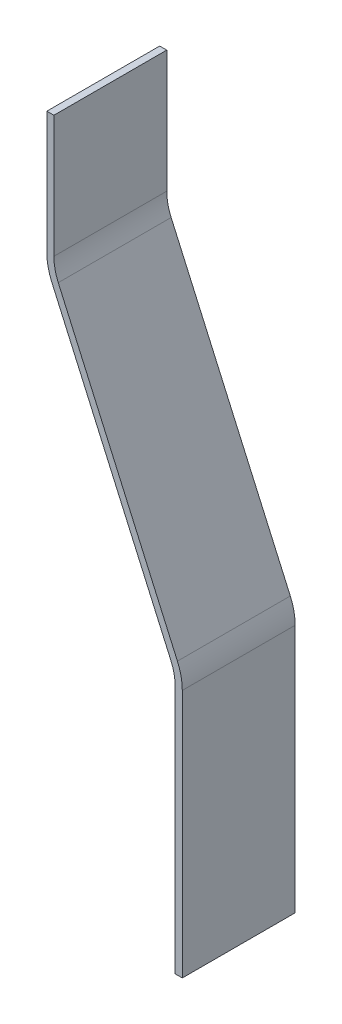
ISO-10303-21;
HEADER;
FILE_DESCRIPTION(('STEP AP214'),'2;1');
FILE_NAME('part.step','',(''),(''),'','','');
FILE_SCHEMA(('AUTOMOTIVE_DESIGN { 1 0 10303 214 1 1 1 1 }'));
ENDSEC;
DATA;
#1=APPLICATION_CONTEXT('core data for automotive mechanical design processes');
#2=APPLICATION_PROTOCOL_DEFINITION('international standard','automotive_design',2000,#1);
#3=PRODUCT_CONTEXT('',#1,'mechanical');
#4=PRODUCT('Part','Part','',(#3));
#5=PRODUCT_RELATED_PRODUCT_CATEGORY('part','',(#4));
#6=PRODUCT_DEFINITION_FORMATION('','',#4);
#7=PRODUCT_DEFINITION_CONTEXT('part definition',#1,'design');
#8=PRODUCT_DEFINITION('design','',#6,#7);
#9=PRODUCT_DEFINITION_SHAPE('','',#8);
#10=(LENGTH_UNIT() NAMED_UNIT(*) SI_UNIT(.MILLI.,.METRE.));
#11=(NAMED_UNIT(*) PLANE_ANGLE_UNIT() SI_UNIT($,.RADIAN.));
#12=(NAMED_UNIT(*) SI_UNIT($,.STERADIAN.) SOLID_ANGLE_UNIT());
#13=UNCERTAINTY_MEASURE_WITH_UNIT(LENGTH_MEASURE(1.E-05),#10,'distance_accuracy_value','');
#14=(GEOMETRIC_REPRESENTATION_CONTEXT(3) GLOBAL_UNCERTAINTY_ASSIGNED_CONTEXT((#13)) GLOBAL_UNIT_ASSIGNED_CONTEXT((#10,
#11,#12)) REPRESENTATION_CONTEXT('',''));
#15=CARTESIAN_POINT('',(0.,0.,0.));
#16=DIRECTION('',(0.,0.,1.));
#17=DIRECTION('',(1.,0.,0.));
#18=AXIS2_PLACEMENT_3D('',#15,#16,#17);
#19=CARTESIAN_POINT('',(60.96,307.367308880783,101.6));
#20=DIRECTION('',(0.,-1.,0.));
#21=DIRECTION('',(0.,0.,-1.));
#22=AXIS2_PLACEMENT_3D('',#19,#20,#21);
#23=PLANE('',#22);
#24=DIRECTION('',(-1.,0.,0.));
#25=VECTOR('',#24,1.);
#26=CARTESIAN_POINT('',(60.96,307.367308880783,0.));
#27=LINE('',#26,#25);
#28=CARTESIAN_POINT('',(67.31,307.367308880783,0.));
#29=VERTEX_POINT('',#28);
#30=CARTESIAN_POINT('',(60.96,307.367308880783,0.));
#31=VERTEX_POINT('',#30);
#32=EDGE_CURVE('E162',#29,#31,#27,.T.);
#33=ORIENTED_EDGE('',*,*,#32,.T.);
#34=DIRECTION('',(0.,0.,-1.));
#35=VECTOR('',#34,1.);
#36=CARTESIAN_POINT('',(60.96,307.367308880783,101.6));
#37=LINE('',#36,#35);
#38=CARTESIAN_POINT('',(60.96,307.367308880783,101.6));
#39=VERTEX_POINT('',#38);
#40=EDGE_CURVE('E11',#39,#31,#37,.T.);
#41=ORIENTED_EDGE('',*,*,#40,.F.);
#42=DIRECTION('',(-1.,0.,0.));
#43=VECTOR('',#42,1.);
#44=CARTESIAN_POINT('',(60.96,307.367308880783,101.6));
#45=LINE('',#44,#43);
#46=CARTESIAN_POINT('',(67.31,307.367308880783,101.6));
#47=VERTEX_POINT('',#46);
#48=EDGE_CURVE('E184',#47,#39,#45,.T.);
#49=ORIENTED_EDGE('',*,*,#48,.F.);
#50=DIRECTION('',(0.,0.,-1.));
#51=VECTOR('',#50,1.);
#52=CARTESIAN_POINT('',(67.31,307.367308880783,101.6));
#53=LINE('',#52,#51);
#54=EDGE_CURVE('E158',#47,#29,#53,.T.);
#55=ORIENTED_EDGE('',*,*,#54,.T.);
#56=EDGE_LOOP('',(#33,#41,#49,#55));
#57=FACE_BOUND('',#56,.T.);
#58=ADVANCED_FACE('F42',(#57),#23,.F.);
#59=CARTESIAN_POINT('',(60.96,197.131308880783,101.6));
#60=DIRECTION('',(1.,0.,0.));
#61=DIRECTION('',(0.,0.,-1.));
#62=AXIS2_PLACEMENT_3D('',#59,#60,#61);
#63=PLANE('',#62);
#64=DIRECTION('',(0.,-1.,0.));
#65=VECTOR('',#64,1.);
#66=CARTESIAN_POINT('',(60.96,197.131308880783,0.));
#67=LINE('',#66,#65);
#68=CARTESIAN_POINT('',(60.96,197.131308880783,0.));
#69=VERTEX_POINT('',#68);
#70=EDGE_CURVE('E165',#31,#69,#67,.T.);
#71=ORIENTED_EDGE('',*,*,#70,.T.);
#72=DIRECTION('',(0.,0.,-1.));
#73=VECTOR('',#72,1.);
#74=CARTESIAN_POINT('',(60.96,197.131308880783,101.6));
#75=LINE('',#74,#73);
#76=CARTESIAN_POINT('',(60.96,197.131308880783,101.6));
#77=VERTEX_POINT('',#76);
#78=EDGE_CURVE('E50',#77,#69,#75,.T.);
#79=ORIENTED_EDGE('',*,*,#78,.F.);
#80=DIRECTION('',(0.,-1.,0.));
#81=VECTOR('',#80,1.);
#82=CARTESIAN_POINT('',(60.96,197.131308880783,101.6));
#83=LINE('',#82,#81);
#84=EDGE_CURVE('E113',#39,#77,#83,.T.);
#85=ORIENTED_EDGE('',*,*,#84,.F.);
#86=ORIENTED_EDGE('',*,*,#40,.T.);
#87=EDGE_LOOP('',(#71,#79,#85,#86));
#88=FACE_BOUND('',#87,.T.);
#89=ADVANCED_FACE('F262',(#88),#63,.F.);
#90=CARTESIAN_POINT('',(111.76,197.131308880783,101.6));
#91=DIRECTION('',(0.,0.,-1.));
#92=DIRECTION('',(-1.,0.,0.));
#93=AXIS2_PLACEMENT_3D('',#90,#91,#92);
#94=CYLINDRICAL_SURFACE('',#93,50.8);
#95=CARTESIAN_POINT('',(111.76,197.131308880783,0.));
#96=DIRECTION('',(0.,0.,1.));
#97=DIRECTION('',(-1.,0.,0.));
#98=AXIS2_PLACEMENT_3D('',#95,#96,#97);
#99=CIRCLE('',#98,50.8);
#100=CARTESIAN_POINT('',(65.3358408581264,176.505173809713,0.));
#101=VERTEX_POINT('',#100);
#102=EDGE_CURVE('E167',#69,#101,#99,.T.);
#103=ORIENTED_EDGE('',*,*,#102,.T.);
#104=DIRECTION('',(0.,0.,-1.));
#105=VECTOR('',#104,1.);
#106=CARTESIAN_POINT('',(65.3358408581264,176.505173809713,101.6));
#107=LINE('',#106,#105);
#108=CARTESIAN_POINT('',(65.3358408581264,176.505173809713,101.6));
#109=VERTEX_POINT('',#108);
#110=EDGE_CURVE('E203',#109,#101,#107,.T.);
#111=ORIENTED_EDGE('',*,*,#110,.F.);
#112=CARTESIAN_POINT('',(111.76,197.131308880783,101.6));
#113=DIRECTION('',(0.,0.,1.));
#114=DIRECTION('',(-1.,0.,0.));
#115=AXIS2_PLACEMENT_3D('',#112,#113,#114);
#116=CIRCLE('',#115,50.8);
#117=EDGE_CURVE('E211',#77,#109,#116,.T.);
#118=ORIENTED_EDGE('',*,*,#117,.F.);
#119=ORIENTED_EDGE('',*,*,#78,.T.);
#120=EDGE_LOOP('',(#103,#111,#118,#119));
#121=FACE_BOUND('',#120,.T.);
#122=ADVANCED_FACE('F209',(#121),#94,.T.);
#123=CARTESIAN_POINT('',(172.591743227686,-64.9004537280294,101.6));
#124=DIRECTION('',(0.913861400430583,0.406026280926559,0.));
#125=DIRECTION('',(-0.406026280926559,0.913861400430583,0.));
#126=AXIS2_PLACEMENT_3D('',#123,#124,#125);
#127=PLANE('',#126);
#128=DIRECTION('',(0.406026280926559,-0.913861400430583,0.));
#129=VECTOR('',#128,1.);
#130=CARTESIAN_POINT('',(172.591743227686,-64.9004537280294,0.));
#131=LINE('',#130,#129);
#132=CARTESIAN_POINT('',(172.591743227686,-64.9004537280294,0.));
#133=VERTEX_POINT('',#132);
#134=EDGE_CURVE('E169',#101,#133,#131,.T.);
#135=ORIENTED_EDGE('',*,*,#134,.T.);
#136=DIRECTION('',(0.,0.,-1.));
#137=VECTOR('',#136,1.);
#138=CARTESIAN_POINT('',(172.591743227686,-64.9004537280294,101.6));
#139=LINE('',#138,#137);
#140=CARTESIAN_POINT('',(172.591743227686,-64.9004537280294,101.6));
#141=VERTEX_POINT('',#140);
#142=EDGE_CURVE('E200',#141,#133,#139,.T.);
#143=ORIENTED_EDGE('',*,*,#142,.F.);
#144=DIRECTION('',(0.406026280926559,-0.913861400430583,0.));
#145=VECTOR('',#144,1.);
#146=CARTESIAN_POINT('',(172.591743227686,-64.9004537280294,101.6));
#147=LINE('',#146,#145);
#148=EDGE_CURVE('E229',#109,#141,#147,.T.);
#149=ORIENTED_EDGE('',*,*,#148,.F.);
#150=ORIENTED_EDGE('',*,*,#110,.T.);
#151=EDGE_LOOP('',(#135,#143,#149,#150));
#152=FACE_BOUND('',#151,.T.);
#153=ADVANCED_FACE('F220',(#152),#127,.F.);
#154=CARTESIAN_POINT('',(130.81,-83.4639752919917,101.6));
#155=DIRECTION('',(0.,0.,-1.));
#156=DIRECTION('',(-1.,0.,0.));
#157=AXIS2_PLACEMENT_3D('',#154,#155,#156);
#158=CYLINDRICAL_SURFACE('',#157,45.72);
#159=CARTESIAN_POINT('',(130.81,-83.4639752919917,0.));
#160=DIRECTION('',(0.,0.,-1.));
#161=DIRECTION('',(1.,0.,0.));
#162=AXIS2_PLACEMENT_3D('',#159,#160,#161);
#163=CIRCLE('',#162,45.72);
#164=CARTESIAN_POINT('',(176.53,-83.4639752919917,0.));
#165=VERTEX_POINT('',#164);
#166=EDGE_CURVE('E171',#133,#165,#163,.T.);
#167=ORIENTED_EDGE('',*,*,#166,.T.);
#168=DIRECTION('',(0.,0.,-1.));
#169=VECTOR('',#168,1.);
#170=CARTESIAN_POINT('',(176.53,-83.4639752919917,101.6));
#171=LINE('',#170,#169);
#172=CARTESIAN_POINT('',(176.53,-83.4639752919917,101.6));
#173=VERTEX_POINT('',#172);
#174=EDGE_CURVE('E197',#173,#165,#171,.T.);
#175=ORIENTED_EDGE('',*,*,#174,.F.);
#176=CARTESIAN_POINT('',(130.81,-83.4639752919917,101.6));
#177=DIRECTION('',(0.,0.,-1.));
#178=DIRECTION('',(1.,0.,0.));
#179=AXIS2_PLACEMENT_3D('',#176,#177,#178);
#180=CIRCLE('',#179,45.72);
#181=EDGE_CURVE('E226',#141,#173,#180,.T.);
#182=ORIENTED_EDGE('',*,*,#181,.F.);
#183=ORIENTED_EDGE('',*,*,#142,.T.);
#184=EDGE_LOOP('',(#167,#175,#182,#183));
#185=FACE_BOUND('',#184,.T.);
#186=ADVANCED_FACE('F224',(#185),#158,.F.);
#187=CARTESIAN_POINT('',(176.53,-307.367308880783,101.6));
#188=DIRECTION('',(1.,0.,0.));
#189=DIRECTION('',(0.,0.,-1.));
#190=AXIS2_PLACEMENT_3D('',#187,#188,#189);
#191=PLANE('',#190);
#192=DIRECTION('',(0.,-1.,0.));
#193=VECTOR('',#192,1.);
#194=CARTESIAN_POINT('',(176.53,-307.367308880783,0.));
#195=LINE('',#194,#193);
#196=CARTESIAN_POINT('',(176.53,-307.367308880783,0.));
#197=VERTEX_POINT('',#196);
#198=EDGE_CURVE('E173',#165,#197,#195,.T.);
#199=ORIENTED_EDGE('',*,*,#198,.T.);
#200=DIRECTION('',(0.,0.,-1.));
#201=VECTOR('',#200,1.);
#202=CARTESIAN_POINT('',(176.53,-307.367308880783,101.6));
#203=LINE('',#202,#201);
#204=CARTESIAN_POINT('',(176.53,-307.367308880783,101.6));
#205=VERTEX_POINT('',#204);
#206=EDGE_CURVE('E194',#205,#197,#203,.T.);
#207=ORIENTED_EDGE('',*,*,#206,.F.);
#208=DIRECTION('',(0.,-1.,0.));
#209=VECTOR('',#208,1.);
#210=CARTESIAN_POINT('',(176.53,-307.367308880783,101.6));
#211=LINE('',#210,#209);
#212=EDGE_CURVE('E228',#173,#205,#211,.T.);
#213=ORIENTED_EDGE('',*,*,#212,.F.);
#214=ORIENTED_EDGE('',*,*,#174,.T.);
#215=EDGE_LOOP('',(#199,#207,#213,#214));
#216=FACE_BOUND('',#215,.T.);
#217=ADVANCED_FACE('F275',(#216),#191,.F.);
#218=CARTESIAN_POINT('',(182.88,-307.367308880783,101.6));
#219=DIRECTION('',(0.,1.,0.));
#220=DIRECTION('',(0.,0.,1.));
#221=AXIS2_PLACEMENT_3D('',#218,#219,#220);
#222=PLANE('',#221);
#223=DIRECTION('',(1.,0.,0.));
#224=VECTOR('',#223,1.);
#225=CARTESIAN_POINT('',(182.88,-307.367308880783,0.));
#226=LINE('',#225,#224);
#227=CARTESIAN_POINT('',(182.88,-307.367308880783,0.));
#228=VERTEX_POINT('',#227);
#229=EDGE_CURVE('E175',#197,#228,#226,.T.);
#230=ORIENTED_EDGE('',*,*,#229,.T.);
#231=DIRECTION('',(0.,0.,-1.));
#232=VECTOR('',#231,1.);
#233=CARTESIAN_POINT('',(182.88,-307.367308880783,101.6));
#234=LINE('',#233,#232);
#235=CARTESIAN_POINT('',(182.88,-307.367308880783,101.6));
#236=VERTEX_POINT('',#235);
#237=EDGE_CURVE('E191',#236,#228,#234,.T.);
#238=ORIENTED_EDGE('',*,*,#237,.F.);
#239=DIRECTION('',(1.,0.,0.));
#240=VECTOR('',#239,1.);
#241=CARTESIAN_POINT('',(182.88,-307.367308880783,101.6));
#242=LINE('',#241,#240);
#243=EDGE_CURVE('E231',#205,#236,#242,.T.);
#244=ORIENTED_EDGE('',*,*,#243,.F.);
#245=ORIENTED_EDGE('',*,*,#206,.T.);
#246=EDGE_LOOP('',(#230,#238,#244,#245));
#247=FACE_BOUND('',#246,.T.);
#248=ADVANCED_FACE('F278',(#247),#222,.F.);
#249=CARTESIAN_POINT('',(182.88,-83.1945444039134,101.6));
#250=DIRECTION('',(-1.,0.,0.));
#251=DIRECTION('',(0.,-1.,0.));
#252=AXIS2_PLACEMENT_3D('',#249,#250,#251);
#253=PLANE('',#252);
#254=DIRECTION('',(0.,1.,0.));
#255=VECTOR('',#254,1.);
#256=CARTESIAN_POINT('',(182.88,-83.1945444039134,0.));
#257=LINE('',#256,#255);
#258=CARTESIAN_POINT('',(182.88,-83.1945444039134,0.));
#259=VERTEX_POINT('',#258);
#260=EDGE_CURVE('E177',#228,#259,#257,.T.);
#261=ORIENTED_EDGE('',*,*,#260,.T.);
#262=DIRECTION('',(0.,0.,-1.));
#263=VECTOR('',#262,1.);
#264=CARTESIAN_POINT('',(182.88,-83.1945444039134,101.6));
#265=LINE('',#264,#263);
#266=CARTESIAN_POINT('',(182.88,-83.1945444039134,101.6));
#267=VERTEX_POINT('',#266);
#268=EDGE_CURVE('E188',#267,#259,#265,.T.);
#269=ORIENTED_EDGE('',*,*,#268,.F.);
#270=DIRECTION('',(0.,1.,0.));
#271=VECTOR('',#270,1.);
#272=CARTESIAN_POINT('',(182.88,-83.1945444039134,101.6));
#273=LINE('',#272,#271);
#274=EDGE_CURVE('E237',#236,#267,#273,.T.);
#275=ORIENTED_EDGE('',*,*,#274,.F.);
#276=ORIENTED_EDGE('',*,*,#237,.T.);
#277=EDGE_LOOP('',(#261,#269,#275,#276));
#278=FACE_BOUND('',#277,.T.);
#279=ADVANCED_FACE('F243',(#278),#253,.F.);
#280=CARTESIAN_POINT('',(132.08,-83.1945444039134,101.6));
#281=DIRECTION('',(0.,0.,-1.));
#282=DIRECTION('',(-1.,0.,0.));
#283=AXIS2_PLACEMENT_3D('',#280,#281,#282);
#284=CYLINDRICAL_SURFACE('',#283,50.8);
#285=CARTESIAN_POINT('',(132.08,-83.1945444039134,0.));
#286=DIRECTION('',(0.,0.,1.));
#287=DIRECTION('',(1.,0.,0.));
#288=AXIS2_PLACEMENT_3D('',#285,#286,#287);
#289=CIRCLE('',#288,50.8);
#290=CARTESIAN_POINT('',(178.504159141874,-62.5684093328442,0.));
#291=VERTEX_POINT('',#290);
#292=EDGE_CURVE('E179',#259,#291,#289,.T.);
#293=ORIENTED_EDGE('',*,*,#292,.T.);
#294=DIRECTION('',(0.,0.,-1.));
#295=VECTOR('',#294,1.);
#296=CARTESIAN_POINT('',(178.504159141874,-62.5684093328442,101.6));
#297=LINE('',#296,#295);
#298=CARTESIAN_POINT('',(178.504159141874,-62.5684093328442,101.6));
#299=VERTEX_POINT('',#298);
#300=EDGE_CURVE('E153',#299,#291,#297,.T.);
#301=ORIENTED_EDGE('',*,*,#300,.F.);
#302=CARTESIAN_POINT('',(132.08,-83.1945444039134,101.6));
#303=DIRECTION('',(0.,0.,1.));
#304=DIRECTION('',(1.,0.,0.));
#305=AXIS2_PLACEMENT_3D('',#302,#303,#304);
#306=CIRCLE('',#305,50.8);
#307=EDGE_CURVE('E144',#267,#299,#306,.T.);
#308=ORIENTED_EDGE('',*,*,#307,.F.);
#309=ORIENTED_EDGE('',*,*,#268,.T.);
#310=EDGE_LOOP('',(#293,#301,#308,#309));
#311=FACE_BOUND('',#310,.T.);
#312=ADVANCED_FACE('F247',(#311),#284,.T.);
#313=CARTESIAN_POINT('',(178.504159141874,-62.5684093328442,101.6));
#314=DIRECTION('',(-0.913861400430583,-0.406026280926559,0.));
#315=DIRECTION('',(0.406026280926559,-0.913861400430583,0.));
#316=AXIS2_PLACEMENT_3D('',#313,#314,#315);
#317=PLANE('',#316);
#318=DIRECTION('',(-0.406026280926559,0.913861400430583,0.));
#319=VECTOR('',#318,1.);
#320=CARTESIAN_POINT('',(178.504159141874,-62.5684093328442,0.));
#321=LINE('',#320,#319);
#322=CARTESIAN_POINT('',(71.2482567723138,178.837218204899,0.));
#323=VERTEX_POINT('',#322);
#324=EDGE_CURVE('E152',#291,#323,#321,.T.);
#325=ORIENTED_EDGE('',*,*,#324,.T.);
#326=DIRECTION('',(0.,0.,-1.));
#327=VECTOR('',#326,1.);
#328=CARTESIAN_POINT('',(71.2482567723138,178.837218204899,101.6));
#329=LINE('',#328,#327);
#330=CARTESIAN_POINT('',(71.2482567723138,178.837218204899,101.6));
#331=VERTEX_POINT('',#330);
#332=EDGE_CURVE('E149',#331,#323,#329,.T.);
#333=ORIENTED_EDGE('',*,*,#332,.F.);
#334=DIRECTION('',(-0.406026280926559,0.913861400430583,0.));
#335=VECTOR('',#334,1.);
#336=CARTESIAN_POINT('',(178.504159141874,-62.5684093328442,101.6));
#337=LINE('',#336,#335);
#338=EDGE_CURVE('E138',#299,#331,#337,.T.);
#339=ORIENTED_EDGE('',*,*,#338,.F.);
#340=ORIENTED_EDGE('',*,*,#300,.T.);
#341=EDGE_LOOP('',(#325,#333,#339,#340));
#342=FACE_BOUND('',#341,.T.);
#343=ADVANCED_FACE('F150',(#342),#317,.F.);
#344=CARTESIAN_POINT('',(113.03,197.400739768861,101.6));
#345=DIRECTION('',(0.,0.,-1.));
#346=DIRECTION('',(-1.,0.,0.));
#347=AXIS2_PLACEMENT_3D('',#344,#345,#346);
#348=CYLINDRICAL_SURFACE('',#347,45.72);
#349=CARTESIAN_POINT('',(113.03,197.400739768861,0.));
#350=DIRECTION('',(0.,0.,-1.));
#351=DIRECTION('',(1.,0.,0.));
#352=AXIS2_PLACEMENT_3D('',#349,#350,#351);
#353=CIRCLE('',#352,45.72);
#354=CARTESIAN_POINT('',(67.31,197.400739768861,0.));
#355=VERTEX_POINT('',#354);
#356=EDGE_CURVE('E99',#323,#355,#353,.T.);
#357=ORIENTED_EDGE('',*,*,#356,.T.);
#358=DIRECTION('',(0.,0.,-1.));
#359=VECTOR('',#358,1.);
#360=CARTESIAN_POINT('',(67.31,197.400739768861,101.6));
#361=LINE('',#360,#359);
#362=CARTESIAN_POINT('',(67.31,197.400739768861,101.6));
#363=VERTEX_POINT('',#362);
#364=EDGE_CURVE('E154',#363,#355,#361,.T.);
#365=ORIENTED_EDGE('',*,*,#364,.F.);
#366=CARTESIAN_POINT('',(113.03,197.400739768861,101.6));
#367=DIRECTION('',(0.,0.,-1.));
#368=DIRECTION('',(1.,0.,0.));
#369=AXIS2_PLACEMENT_3D('',#366,#367,#368);
#370=CIRCLE('',#369,45.72);
#371=EDGE_CURVE('E142',#331,#363,#370,.T.);
#372=ORIENTED_EDGE('',*,*,#371,.F.);
#373=ORIENTED_EDGE('',*,*,#332,.T.);
#374=EDGE_LOOP('',(#357,#365,#372,#373));
#375=FACE_BOUND('',#374,.T.);
#376=ADVANCED_FACE('F156',(#375),#348,.F.);
#377=CARTESIAN_POINT('',(67.31,197.400739768861,101.6));
#378=DIRECTION('',(-1.,0.,0.));
#379=DIRECTION('',(0.,-1.,0.));
#380=AXIS2_PLACEMENT_3D('',#377,#378,#379);
#381=PLANE('',#380);
#382=DIRECTION('',(0.,1.,0.));
#383=VECTOR('',#382,1.);
#384=CARTESIAN_POINT('',(67.31,197.400739768861,0.));
#385=LINE('',#384,#383);
#386=EDGE_CURVE('E105',#355,#29,#385,.T.);
#387=ORIENTED_EDGE('',*,*,#386,.T.);
#388=ORIENTED_EDGE('',*,*,#54,.F.);
#389=DIRECTION('',(0.,1.,0.));
#390=VECTOR('',#389,1.);
#391=CARTESIAN_POINT('',(67.31,197.400739768861,101.6));
#392=LINE('',#391,#390);
#393=EDGE_CURVE('E58',#363,#47,#392,.T.);
#394=ORIENTED_EDGE('',*,*,#393,.F.);
#395=ORIENTED_EDGE('',*,*,#364,.T.);
#396=EDGE_LOOP('',(#387,#388,#394,#395));
#397=FACE_BOUND('',#396,.T.);
#398=ADVANCED_FACE('F251',(#397),#381,.F.);
#399=CARTESIAN_POINT('',(113.03,197.400739768861,101.6));
#400=DIRECTION('',(0.,0.,1.));
#401=DIRECTION('',(1.,0.,0.));
#402=AXIS2_PLACEMENT_3D('',#399,#400,#401);
#403=PLANE('',#402);
#404=ORIENTED_EDGE('',*,*,#48,.T.);
#405=ORIENTED_EDGE('',*,*,#84,.T.);
#406=ORIENTED_EDGE('',*,*,#117,.T.);
#407=ORIENTED_EDGE('',*,*,#148,.T.);
#408=ORIENTED_EDGE('',*,*,#181,.T.);
#409=ORIENTED_EDGE('',*,*,#212,.T.);
#410=ORIENTED_EDGE('',*,*,#243,.T.);
#411=ORIENTED_EDGE('',*,*,#274,.T.);
#412=ORIENTED_EDGE('',*,*,#307,.T.);
#413=ORIENTED_EDGE('',*,*,#338,.T.);
#414=ORIENTED_EDGE('',*,*,#371,.T.);
#415=ORIENTED_EDGE('',*,*,#393,.T.);
#416=EDGE_LOOP('',(#404,#405,#406,#407,#408,#409,#410,#411,#412,#413,#414,#415));
#417=FACE_BOUND('',#416,.T.);
#418=ADVANCED_FACE('F140',(#417),#403,.T.);
#419=CARTESIAN_POINT('',(113.03,197.400739768861,0.));
#420=DIRECTION('',(0.,0.,1.));
#421=DIRECTION('',(1.,0.,0.));
#422=AXIS2_PLACEMENT_3D('',#419,#420,#421);
#423=PLANE('',#422);
#424=ORIENTED_EDGE('',*,*,#32,.F.);
#425=ORIENTED_EDGE('',*,*,#386,.F.);
#426=ORIENTED_EDGE('',*,*,#356,.F.);
#427=ORIENTED_EDGE('',*,*,#324,.F.);
#428=ORIENTED_EDGE('',*,*,#292,.F.);
#429=ORIENTED_EDGE('',*,*,#260,.F.);
#430=ORIENTED_EDGE('',*,*,#229,.F.);
#431=ORIENTED_EDGE('',*,*,#198,.F.);
#432=ORIENTED_EDGE('',*,*,#166,.F.);
#433=ORIENTED_EDGE('',*,*,#134,.F.);
#434=ORIENTED_EDGE('',*,*,#102,.F.);
#435=ORIENTED_EDGE('',*,*,#70,.F.);
#436=EDGE_LOOP('',(#424,#425,#426,#427,#428,#429,#430,#431,#432,#433,#434,#435));
#437=FACE_BOUND('',#436,.T.);
#438=ADVANCED_FACE('F215',(#437),#423,.F.);
#439=CLOSED_SHELL('',(#58,#89,#122,#153,#186,#217,#248,#279,#312,#343,#376,#398,#418,#438));
#440=MANIFOLD_SOLID_BREP('B2',#439);
#441=ADVANCED_BREP_SHAPE_REPRESENTATION('',(#18,#440),#14);
#442=SHAPE_DEFINITION_REPRESENTATION(#9,#441);
ENDSEC;
END-ISO-10303-21;
